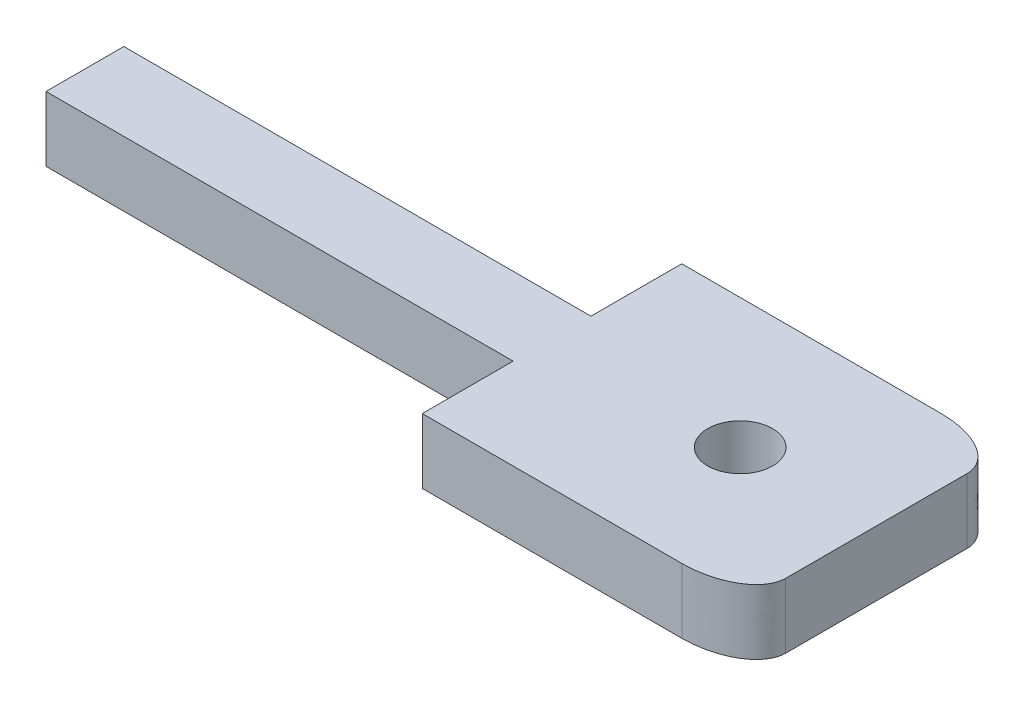
ISO-10303-21;
HEADER;
FILE_DESCRIPTION(('STEP AP214'),'2;1');
FILE_NAME('part.step','',(''),(''),'','','');
FILE_SCHEMA(('AUTOMOTIVE_DESIGN { 1 0 10303 214 1 1 1 1 }'));
ENDSEC;
DATA;
#1=APPLICATION_CONTEXT('core data for automotive mechanical design processes');
#2=APPLICATION_PROTOCOL_DEFINITION('international standard','automotive_design',2000,#1);
#3=PRODUCT_CONTEXT('',#1,'mechanical');
#4=PRODUCT('Part','Part','',(#3));
#5=PRODUCT_RELATED_PRODUCT_CATEGORY('part','',(#4));
#6=PRODUCT_DEFINITION_FORMATION('','',#4);
#7=PRODUCT_DEFINITION_CONTEXT('part definition',#1,'design');
#8=PRODUCT_DEFINITION('design','',#6,#7);
#9=PRODUCT_DEFINITION_SHAPE('','',#8);
#10=(LENGTH_UNIT() NAMED_UNIT(*) SI_UNIT(.MILLI.,.METRE.));
#11=(NAMED_UNIT(*) PLANE_ANGLE_UNIT() SI_UNIT($,.RADIAN.));
#12=(NAMED_UNIT(*) SI_UNIT($,.STERADIAN.) SOLID_ANGLE_UNIT());
#13=UNCERTAINTY_MEASURE_WITH_UNIT(LENGTH_MEASURE(1.E-05),#10,'distance_accuracy_value','');
#14=(GEOMETRIC_REPRESENTATION_CONTEXT(3) GLOBAL_UNCERTAINTY_ASSIGNED_CONTEXT((#13)) GLOBAL_UNIT_ASSIGNED_CONTEXT((#10,
#11,#12)) REPRESENTATION_CONTEXT('',''));
#15=CARTESIAN_POINT('',(0.,0.,0.));
#16=DIRECTION('',(0.,0.,1.));
#17=DIRECTION('',(1.,0.,0.));
#18=AXIS2_PLACEMENT_3D('',#15,#16,#17);
#19=CARTESIAN_POINT('',(-12.5,-2.5,20.));
#20=DIRECTION('',(1.,0.,0.));
#21=DIRECTION('',(0.,0.,-1.));
#22=AXIS2_PLACEMENT_3D('',#19,#20,#21);
#23=PLANE('',#22);
#24=DIRECTION('',(0.,-1.,0.));
#25=VECTOR('',#24,1.);
#26=CARTESIAN_POINT('',(-12.5,38.9965751817893,6.99999999998776));
#27=LINE('',#26,#25);
#28=CARTESIAN_POINT('',(-12.5,2.5,6.99999999998776));
#29=VERTEX_POINT('',#28);
#30=CARTESIAN_POINT('',(-12.5,-2.5,6.99999999998776));
#31=VERTEX_POINT('',#30);
#32=EDGE_CURVE('E132',#29,#31,#27,.T.);
#33=ORIENTED_EDGE('',*,*,#32,.F.);
#34=DIRECTION('',(0.,0.,-1.));
#35=VECTOR('',#34,1.);
#36=CARTESIAN_POINT('',(-12.5,2.5,20.));
#37=LINE('',#36,#35);
#38=CARTESIAN_POINT('',(-12.5,2.5,0.));
#39=VERTEX_POINT('',#38);
#40=EDGE_CURVE('E241',#29,#39,#37,.T.);
#41=ORIENTED_EDGE('',*,*,#40,.T.);
#42=DIRECTION('',(0.,-1.,0.));
#43=VECTOR('',#42,1.);
#44=CARTESIAN_POINT('',(-12.5,-2.5,0.));
#45=LINE('',#44,#43);
#46=CARTESIAN_POINT('',(-12.5,-2.5,0.));
#47=VERTEX_POINT('',#46);
#48=EDGE_CURVE('E186',#39,#47,#45,.T.);
#49=ORIENTED_EDGE('',*,*,#48,.T.);
#50=DIRECTION('',(0.,0.,-1.));
#51=VECTOR('',#50,1.);
#52=CARTESIAN_POINT('',(-12.5,-2.5,20.));
#53=LINE('',#52,#51);
#54=EDGE_CURVE('E234',#31,#47,#53,.T.);
#55=ORIENTED_EDGE('',*,*,#54,.F.);
#56=EDGE_LOOP('',(#33,#41,#49,#55));
#57=FACE_BOUND('',#56,.T.);
#58=ADVANCED_FACE('F38',(#57),#23,.F.);
#59=CARTESIAN_POINT('',(12.5,-2.5,20.));
#60=DIRECTION('',(-1.,0.,0.));
#61=DIRECTION('',(0.,0.,1.));
#62=AXIS2_PLACEMENT_3D('',#59,#60,#61);
#63=PLANE('',#62);
#64=DIRECTION('',(0.,0.,-1.));
#65=VECTOR('',#64,1.);
#66=CARTESIAN_POINT('',(12.5,2.5,20.));
#67=LINE('',#66,#65);
#68=CARTESIAN_POINT('',(12.5,2.5,17.));
#69=VERTEX_POINT('',#68);
#70=CARTESIAN_POINT('',(12.5,2.5,3.));
#71=VERTEX_POINT('',#70);
#72=EDGE_CURVE('E194',#69,#71,#67,.T.);
#73=ORIENTED_EDGE('',*,*,#72,.F.);
#74=CARTESIAN_POINT('',(12.5,-2.75,17.));
#75=CARTESIAN_POINT('',(12.5,-0.916666666666667,17.));
#76=CARTESIAN_POINT('',(12.5,0.916666666666667,17.));
#77=CARTESIAN_POINT('',(12.5,2.75,17.));
#78=(BOUNDED_CURVE() B_SPLINE_CURVE(3,(#74,#75,#76,#77),.UNSPECIFIED.,.F.,
.F.) B_SPLINE_CURVE_WITH_KNOTS((4,4),(-0.00275,0.00275),
.UNSPECIFIED.) CURVE() GEOMETRIC_REPRESENTATION_ITEM() RATIONAL_B_SPLINE_CURVE((1.,1.,1.,1.)) REPRESENTATION_ITEM(''));
#79=CARTESIAN_POINT('',(12.5,-2.5,17.));
#80=VERTEX_POINT('',#79);
#81=EDGE_CURVE('E338',#69,#80,#78,.F.);
#82=ORIENTED_EDGE('',*,*,#81,.T.);
#83=DIRECTION('',(0.,0.,-1.));
#84=VECTOR('',#83,1.);
#85=CARTESIAN_POINT('',(12.5,-2.5,20.));
#86=LINE('',#85,#84);
#87=CARTESIAN_POINT('',(12.5,-2.5,3.));
#88=VERTEX_POINT('',#87);
#89=EDGE_CURVE('E179',#80,#88,#86,.T.);
#90=ORIENTED_EDGE('',*,*,#89,.T.);
#91=CARTESIAN_POINT('',(12.5,2.75,3.));
#92=CARTESIAN_POINT('',(12.5,0.916666666666669,3.));
#93=CARTESIAN_POINT('',(12.5,-0.916666666666669,3.));
#94=CARTESIAN_POINT('',(12.5,-2.75,3.));
#95=(BOUNDED_CURVE() B_SPLINE_CURVE(3,(#91,#92,#93,#94),.UNSPECIFIED.,.F.,
.F.) B_SPLINE_CURVE_WITH_KNOTS((4,4),(-0.00525,0.00025),
.UNSPECIFIED.) CURVE() GEOMETRIC_REPRESENTATION_ITEM() RATIONAL_B_SPLINE_CURVE((1.,1.,1.,1.)) REPRESENTATION_ITEM(''));
#96=EDGE_CURVE('E359',#88,#71,#95,.F.);
#97=ORIENTED_EDGE('',*,*,#96,.T.);
#98=EDGE_LOOP('',(#73,#82,#90,#97));
#99=FACE_BOUND('',#98,.T.);
#100=ADVANCED_FACE('F218',(#99),#63,.F.);
#101=CARTESIAN_POINT('',(-12.5,2.5,20.));
#102=DIRECTION('',(0.,-1.,0.));
#103=DIRECTION('',(0.,0.,-1.));
#104=AXIS2_PLACEMENT_3D('',#101,#102,#103);
#105=PLANE('',#104);
#106=CARTESIAN_POINT('',(2.,2.5,10.));
#107=DIRECTION('',(0.,-1.,0.));
#108=DIRECTION('',(0.,0.,-1.));
#109=AXIS2_PLACEMENT_3D('',#106,#107,#108);
#110=CIRCLE('',#109,2.5);
#111=CARTESIAN_POINT('',(2.,2.5,7.5));
#112=VERTEX_POINT('',#111);
#113=EDGE_CURVE('E161',#112,#112,#110,.T.);
#114=ORIENTED_EDGE('',*,*,#113,.T.);
#115=EDGE_LOOP('',(#114));
#116=FACE_BOUND('',#115,.T.);
#117=DIRECTION('',(-1.,0.,0.));
#118=VECTOR('',#117,1.);
#119=CARTESIAN_POINT('',(6.5,2.5,20.));
#120=LINE('',#119,#118);
#121=CARTESIAN_POINT('',(7.5,2.5,20.));
#122=VERTEX_POINT('',#121);
#123=CARTESIAN_POINT('',(-12.5,2.5,20.));
#124=VERTEX_POINT('',#123);
#125=EDGE_CURVE('E170',#122,#124,#120,.T.);
#126=ORIENTED_EDGE('',*,*,#125,.F.);
#127=CARTESIAN_POINT('',(12.5,2.5,17.));
#128=CARTESIAN_POINT('',(12.5,2.5,20.));
#129=CARTESIAN_POINT('',(7.5,2.5,20.));
#130=(BOUNDED_CURVE() B_SPLINE_CURVE(2,(#127,#128,#129),.UNSPECIFIED.,.F.,
.F.) B_SPLINE_CURVE_WITH_KNOTS((3,3),(0.,1.),
.UNSPECIFIED.) CURVE() GEOMETRIC_REPRESENTATION_ITEM() RATIONAL_B_SPLINE_CURVE((1.,
0.707106781186548,1.)) REPRESENTATION_ITEM(''));
#131=EDGE_CURVE('E297',#122,#69,#130,.F.);
#132=ORIENTED_EDGE('',*,*,#131,.T.);
#133=ORIENTED_EDGE('',*,*,#72,.T.);
#134=CARTESIAN_POINT('',(7.5,2.5,0.));
#135=CARTESIAN_POINT('',(12.5,2.5,0.));
#136=CARTESIAN_POINT('',(12.5,2.5,3.));
#137=(BOUNDED_CURVE() B_SPLINE_CURVE(2,(#134,#135,#136),.UNSPECIFIED.,.F.,
.F.) B_SPLINE_CURVE_WITH_KNOTS((3,3),(0.,1.),
.UNSPECIFIED.) CURVE() GEOMETRIC_REPRESENTATION_ITEM() RATIONAL_B_SPLINE_CURVE((1.,
0.707106781186548,1.)) REPRESENTATION_ITEM(''));
#138=CARTESIAN_POINT('',(7.5,2.5,0.));
#139=VERTEX_POINT('',#138);
#140=EDGE_CURVE('E201',#71,#139,#137,.F.);
#141=ORIENTED_EDGE('',*,*,#140,.T.);
#142=DIRECTION('',(-1.,0.,0.));
#143=VECTOR('',#142,1.);
#144=CARTESIAN_POINT('',(-12.5,2.5,0.));
#145=LINE('',#144,#143);
#146=EDGE_CURVE('E164',#139,#39,#145,.T.);
#147=ORIENTED_EDGE('',*,*,#146,.T.);
#148=ORIENTED_EDGE('',*,*,#40,.F.);
#149=DIRECTION('',(1.,0.,0.));
#150=VECTOR('',#149,1.);
#151=CARTESIAN_POINT('',(-12.5,2.5,6.99999999998776));
#152=LINE('',#151,#150);
#153=CARTESIAN_POINT('',(-48.5,2.5,6.99999999998776));
#154=VERTEX_POINT('',#153);
#155=EDGE_CURVE('E151',#154,#29,#152,.T.);
#156=ORIENTED_EDGE('',*,*,#155,.F.);
#157=DIRECTION('',(0.,0.,-1.));
#158=VECTOR('',#157,1.);
#159=CARTESIAN_POINT('',(-48.5,2.5,6.99999999998776));
#160=LINE('',#159,#158);
#161=CARTESIAN_POINT('',(-48.5,2.5,12.9999999999878));
#162=VERTEX_POINT('',#161);
#163=EDGE_CURVE('E129',#162,#154,#160,.T.);
#164=ORIENTED_EDGE('',*,*,#163,.F.);
#165=DIRECTION('',(-1.,0.,0.));
#166=VECTOR('',#165,1.);
#167=CARTESIAN_POINT('',(-12.5,2.5,12.9999999999878));
#168=LINE('',#167,#166);
#169=CARTESIAN_POINT('',(-12.5,2.5,12.9999999999878));
#170=VERTEX_POINT('',#169);
#171=EDGE_CURVE('E152',#170,#162,#168,.T.);
#172=ORIENTED_EDGE('',*,*,#171,.F.);
#173=EDGE_CURVE('E198',#124,#170,#37,.T.);
#174=ORIENTED_EDGE('',*,*,#173,.F.);
#175=EDGE_LOOP('',(#126,#132,#133,#141,#147,#148,#156,#164,#172,#174));
#176=FACE_BOUND('',#175,.T.);
#177=ADVANCED_FACE('F207',(#116,#176),#105,.F.);
#178=ORIENTED_EDGE('',*,*,#173,.T.);
#179=DIRECTION('',(0.,-1.,0.));
#180=VECTOR('',#179,1.);
#181=CARTESIAN_POINT('',(-12.5,38.9965751817893,12.9999999999878));
#182=LINE('',#181,#180);
#183=CARTESIAN_POINT('',(-12.5,-2.5,12.9999999999878));
#184=VERTEX_POINT('',#183);
#185=EDGE_CURVE('E145',#170,#184,#182,.T.);
#186=ORIENTED_EDGE('',*,*,#185,.T.);
#187=CARTESIAN_POINT('',(-12.5,-2.5,20.));
#188=VERTEX_POINT('',#187);
#189=EDGE_CURVE('E240',#188,#184,#53,.T.);
#190=ORIENTED_EDGE('',*,*,#189,.F.);
#191=DIRECTION('',(0.,-1.,0.));
#192=VECTOR('',#191,1.);
#193=CARTESIAN_POINT('',(-12.5,-2.5,20.));
#194=LINE('',#193,#192);
#195=EDGE_CURVE('E167',#124,#188,#194,.T.);
#196=ORIENTED_EDGE('',*,*,#195,.F.);
#197=EDGE_LOOP('',(#178,#186,#190,#196));
#198=FACE_BOUND('',#197,.T.);
#199=ADVANCED_FACE('F217',(#198),#23,.F.);
#200=CARTESIAN_POINT('',(-12.5,-2.5,20.));
#201=DIRECTION('',(0.,1.,0.));
#202=DIRECTION('',(0.,0.,1.));
#203=AXIS2_PLACEMENT_3D('',#200,#201,#202);
#204=PLANE('',#203);
#205=CARTESIAN_POINT('',(2.,-2.5,10.));
#206=DIRECTION('',(0.,1.,0.));
#207=DIRECTION('',(0.,0.,1.));
#208=AXIS2_PLACEMENT_3D('',#205,#206,#207);
#209=CIRCLE('',#208,2.5);
#210=CARTESIAN_POINT('',(2.,-2.5,12.5));
#211=VERTEX_POINT('',#210);
#212=EDGE_CURVE('E153',#211,#211,#209,.T.);
#213=ORIENTED_EDGE('',*,*,#212,.T.);
#214=EDGE_LOOP('',(#213));
#215=FACE_BOUND('',#214,.T.);
#216=ORIENTED_EDGE('',*,*,#89,.F.);
#217=CARTESIAN_POINT('',(7.5,-2.5,20.));
#218=CARTESIAN_POINT('',(12.5,-2.5,20.));
#219=CARTESIAN_POINT('',(12.5,-2.5,17.));
#220=(BOUNDED_CURVE() B_SPLINE_CURVE(2,(#217,#218,#219),.UNSPECIFIED.,.F.,
.F.) B_SPLINE_CURVE_WITH_KNOTS((3,3),(0.,1.),
.UNSPECIFIED.) CURVE() GEOMETRIC_REPRESENTATION_ITEM() RATIONAL_B_SPLINE_CURVE((1.,
0.707106781186548,1.)) REPRESENTATION_ITEM(''));
#221=CARTESIAN_POINT('',(7.5,-2.5,20.));
#222=VERTEX_POINT('',#221);
#223=EDGE_CURVE('E52',#80,#222,#220,.F.);
#224=ORIENTED_EDGE('',*,*,#223,.T.);
#225=DIRECTION('',(1.,0.,0.));
#226=VECTOR('',#225,1.);
#227=CARTESIAN_POINT('',(-12.5,-2.5,20.));
#228=LINE('',#227,#226);
#229=EDGE_CURVE('E176',#188,#222,#228,.T.);
#230=ORIENTED_EDGE('',*,*,#229,.F.);
#231=ORIENTED_EDGE('',*,*,#189,.T.);
#232=DIRECTION('',(-1.,0.,0.));
#233=VECTOR('',#232,1.);
#234=CARTESIAN_POINT('',(-12.5,-2.5,12.9999999999878));
#235=LINE('',#234,#233);
#236=CARTESIAN_POINT('',(-48.5,-2.5,12.9999999999878));
#237=VERTEX_POINT('',#236);
#238=EDGE_CURVE('E59',#184,#237,#235,.T.);
#239=ORIENTED_EDGE('',*,*,#238,.T.);
#240=DIRECTION('',(0.,0.,-1.));
#241=VECTOR('',#240,1.);
#242=CARTESIAN_POINT('',(-48.5,-2.5,6.99999999998776));
#243=LINE('',#242,#241);
#244=CARTESIAN_POINT('',(-48.5,-2.5,6.99999999998776));
#245=VERTEX_POINT('',#244);
#246=EDGE_CURVE('E128',#237,#245,#243,.T.);
#247=ORIENTED_EDGE('',*,*,#246,.T.);
#248=DIRECTION('',(1.,0.,0.));
#249=VECTOR('',#248,1.);
#250=CARTESIAN_POINT('',(-12.5,-2.5,6.99999999998776));
#251=LINE('',#250,#249);
#252=EDGE_CURVE('E139',#245,#31,#251,.T.);
#253=ORIENTED_EDGE('',*,*,#252,.T.);
#254=ORIENTED_EDGE('',*,*,#54,.T.);
#255=DIRECTION('',(1.,0.,0.));
#256=VECTOR('',#255,1.);
#257=CARTESIAN_POINT('',(-12.5,-2.5,0.));
#258=LINE('',#257,#256);
#259=CARTESIAN_POINT('',(7.5,-2.5,0.));
#260=VERTEX_POINT('',#259);
#261=EDGE_CURVE('E173',#47,#260,#258,.T.);
#262=ORIENTED_EDGE('',*,*,#261,.T.);
#263=CARTESIAN_POINT('',(12.5,-2.5,3.));
#264=CARTESIAN_POINT('',(12.5,-2.5,0.));
#265=CARTESIAN_POINT('',(7.5,-2.5,0.));
#266=(BOUNDED_CURVE() B_SPLINE_CURVE(2,(#263,#264,#265),.UNSPECIFIED.,.F.,
.F.) B_SPLINE_CURVE_WITH_KNOTS((3,3),(0.,1.),
.UNSPECIFIED.) CURVE() GEOMETRIC_REPRESENTATION_ITEM() RATIONAL_B_SPLINE_CURVE((1.,
0.707106781186548,1.)) REPRESENTATION_ITEM(''));
#267=EDGE_CURVE('E260',#260,#88,#266,.F.);
#268=ORIENTED_EDGE('',*,*,#267,.T.);
#269=EDGE_LOOP('',(#216,#224,#230,#231,#239,#247,#253,#254,#262,#268));
#270=FACE_BOUND('',#269,.T.);
#271=ADVANCED_FACE('F138',(#215,#270),#204,.F.);
#272=CARTESIAN_POINT('',(0.,0.,20.));
#273=DIRECTION('',(0.,0.,-1.));
#274=DIRECTION('',(-1.,0.,0.));
#275=AXIS2_PLACEMENT_3D('',#272,#273,#274);
#276=PLANE('',#275);
#277=ORIENTED_EDGE('',*,*,#229,.T.);
#278=CARTESIAN_POINT('',(7.5,2.75,20.));
#279=CARTESIAN_POINT('',(7.5,0.916666666666667,20.));
#280=CARTESIAN_POINT('',(7.5,-0.916666666666667,20.));
#281=CARTESIAN_POINT('',(7.5,-2.75,20.));
#282=(BOUNDED_CURVE() B_SPLINE_CURVE(3,(#278,#279,#280,#281),.UNSPECIFIED.,.F.,
.F.) B_SPLINE_CURVE_WITH_KNOTS((4,4),(-0.00275,0.00275),
.UNSPECIFIED.) CURVE() GEOMETRIC_REPRESENTATION_ITEM() RATIONAL_B_SPLINE_CURVE((1.,1.,1.,1.)) REPRESENTATION_ITEM(''));
#283=EDGE_CURVE('E197',#222,#122,#282,.F.);
#284=ORIENTED_EDGE('',*,*,#283,.T.);
#285=ORIENTED_EDGE('',*,*,#125,.T.);
#286=ORIENTED_EDGE('',*,*,#195,.T.);
#287=EDGE_LOOP('',(#277,#284,#285,#286));
#288=FACE_BOUND('',#287,.T.);
#289=ADVANCED_FACE('F273',(#288),#276,.F.);
#290=CARTESIAN_POINT('',(0.,0.,0.));
#291=DIRECTION('',(0.,0.,-1.));
#292=DIRECTION('',(-1.,0.,0.));
#293=AXIS2_PLACEMENT_3D('',#290,#291,#292);
#294=PLANE('',#293);
#295=ORIENTED_EDGE('',*,*,#146,.F.);
#296=CARTESIAN_POINT('',(7.5,-2.75,0.));
#297=CARTESIAN_POINT('',(7.5,-0.916666666666669,0.));
#298=CARTESIAN_POINT('',(7.5,0.916666666666669,0.));
#299=CARTESIAN_POINT('',(7.5,2.75,0.));
#300=(BOUNDED_CURVE() B_SPLINE_CURVE(3,(#296,#297,#298,#299),.UNSPECIFIED.,.F.,
.F.) B_SPLINE_CURVE_WITH_KNOTS((4,4),(-0.00525,0.00025),
.UNSPECIFIED.) CURVE() GEOMETRIC_REPRESENTATION_ITEM() RATIONAL_B_SPLINE_CURVE((1.,1.,1.,1.)) REPRESENTATION_ITEM(''));
#301=EDGE_CURVE('E12',#139,#260,#300,.F.);
#302=ORIENTED_EDGE('',*,*,#301,.T.);
#303=ORIENTED_EDGE('',*,*,#261,.F.);
#304=ORIENTED_EDGE('',*,*,#48,.F.);
#305=EDGE_LOOP('',(#295,#302,#303,#304));
#306=FACE_BOUND('',#305,.T.);
#307=ADVANCED_FACE('F251',(#306),#294,.T.);
#308=CARTESIAN_POINT('',(2.,-2.5,10.));
#309=DIRECTION('',(0.,1.,0.));
#310=DIRECTION('',(0.,0.,1.));
#311=AXIS2_PLACEMENT_3D('',#308,#309,#310);
#312=CYLINDRICAL_SURFACE('',#311,2.5);
#313=ORIENTED_EDGE('',*,*,#212,.F.);
#314=EDGE_LOOP('',(#313));
#315=FACE_BOUND('',#314,.T.);
#316=ORIENTED_EDGE('',*,*,#113,.F.);
#317=EDGE_LOOP('',(#316));
#318=FACE_BOUND('',#317,.T.);
#319=ADVANCED_FACE('F315',(#315,#318),#312,.F.);
#320=CARTESIAN_POINT('',(7.5,-2.75,20.));
#321=CARTESIAN_POINT('',(7.5,-0.916666666666667,20.));
#322=CARTESIAN_POINT('',(7.5,0.916666666666667,20.));
#323=CARTESIAN_POINT('',(7.5,2.75,20.));
#324=CARTESIAN_POINT('',(12.5,-2.75,20.));
#325=CARTESIAN_POINT('',(12.5,-0.916666666666667,20.));
#326=CARTESIAN_POINT('',(12.5,0.916666666666667,20.));
#327=CARTESIAN_POINT('',(12.5,2.75,20.));
#328=CARTESIAN_POINT('',(12.5,-2.75,17.));
#329=CARTESIAN_POINT('',(12.5,-0.916666666666667,17.));
#330=CARTESIAN_POINT('',(12.5,0.916666666666667,17.));
#331=CARTESIAN_POINT('',(12.5,2.75,17.));
#332=(BOUNDED_SURFACE() B_SPLINE_SURFACE(2,3,((#320,#321,#322,#323),(#324,#325,#326,#327),(#328,
#329,#330,#331)),.UNSPECIFIED.,.F.,.F.,.F.) B_SPLINE_SURFACE_WITH_KNOTS((3,3),(4,4),(0.,1.),
(-0.00275,0.00275),
.UNSPECIFIED.) GEOMETRIC_REPRESENTATION_ITEM() RATIONAL_B_SPLINE_SURFACE(((1.,1.,1.,1.),
(0.707106781186548,0.707106781186548,0.707106781186548,0.707106781186548),(1.,1.,1.,1.))) REPRESENTATION_ITEM('') SURFACE());
#333=ORIENTED_EDGE('',*,*,#223,.F.);
#334=ORIENTED_EDGE('',*,*,#81,.F.);
#335=ORIENTED_EDGE('',*,*,#131,.F.);
#336=ORIENTED_EDGE('',*,*,#283,.F.);
#337=EDGE_LOOP('',(#333,#334,#335,#336));
#338=FACE_BOUND('',#337,.T.);
#339=ADVANCED_FACE('F303',(#338),#332,.T.);
#340=CARTESIAN_POINT('',(7.5,2.75,0.));
#341=CARTESIAN_POINT('',(7.5,0.916666666666669,0.));
#342=CARTESIAN_POINT('',(7.5,-0.916666666666669,0.));
#343=CARTESIAN_POINT('',(7.5,-2.75,0.));
#344=CARTESIAN_POINT('',(12.5,2.75,0.));
#345=CARTESIAN_POINT('',(12.5,0.916666666666669,0.));
#346=CARTESIAN_POINT('',(12.5,-0.916666666666669,0.));
#347=CARTESIAN_POINT('',(12.5,-2.75,0.));
#348=CARTESIAN_POINT('',(12.5,2.75,3.));
#349=CARTESIAN_POINT('',(12.5,0.916666666666669,3.));
#350=CARTESIAN_POINT('',(12.5,-0.916666666666669,3.));
#351=CARTESIAN_POINT('',(12.5,-2.75,3.));
#352=(BOUNDED_SURFACE() B_SPLINE_SURFACE(2,3,((#340,#341,#342,#343),(#344,#345,#346,#347),(#348,
#349,#350,#351)),.UNSPECIFIED.,.F.,.F.,.F.) B_SPLINE_SURFACE_WITH_KNOTS((3,3),(4,4),(0.,1.),
(-0.00525,0.00025),
.UNSPECIFIED.) GEOMETRIC_REPRESENTATION_ITEM() RATIONAL_B_SPLINE_SURFACE(((1.,1.,1.,1.),
(0.707106781186548,0.707106781186548,0.707106781186548,0.707106781186548),(1.,1.,1.,1.))) REPRESENTATION_ITEM('') SURFACE());
#353=ORIENTED_EDGE('',*,*,#267,.F.);
#354=ORIENTED_EDGE('',*,*,#301,.F.);
#355=ORIENTED_EDGE('',*,*,#140,.F.);
#356=ORIENTED_EDGE('',*,*,#96,.F.);
#357=EDGE_LOOP('',(#353,#354,#355,#356));
#358=FACE_BOUND('',#357,.T.);
#359=ADVANCED_FACE('F41',(#358),#352,.T.);
#360=CARTESIAN_POINT('',(-12.5,38.9965751817893,12.9999999999878));
#361=DIRECTION('',(0.,0.,-1.));
#362=DIRECTION('',(-1.,0.,0.));
#363=AXIS2_PLACEMENT_3D('',#360,#361,#362);
#364=PLANE('',#363);
#365=ORIENTED_EDGE('',*,*,#185,.F.);
#366=ORIENTED_EDGE('',*,*,#171,.T.);
#367=DIRECTION('',(0.,-1.,0.));
#368=VECTOR('',#367,1.);
#369=CARTESIAN_POINT('',(-48.5,38.9965751817893,12.9999999999878));
#370=LINE('',#369,#368);
#371=EDGE_CURVE('E133',#162,#237,#370,.T.);
#372=ORIENTED_EDGE('',*,*,#371,.T.);
#373=ORIENTED_EDGE('',*,*,#238,.F.);
#374=EDGE_LOOP('',(#365,#366,#372,#373));
#375=FACE_BOUND('',#374,.T.);
#376=ADVANCED_FACE('F377',(#375),#364,.F.);
#377=CARTESIAN_POINT('',(-48.5,38.9965751817893,6.99999999998776));
#378=DIRECTION('',(1.,0.,0.));
#379=DIRECTION('',(0.,0.,-1.));
#380=AXIS2_PLACEMENT_3D('',#377,#378,#379);
#381=PLANE('',#380);
#382=ORIENTED_EDGE('',*,*,#371,.F.);
#383=ORIENTED_EDGE('',*,*,#163,.T.);
#384=DIRECTION('',(0.,-1.,0.));
#385=VECTOR('',#384,1.);
#386=CARTESIAN_POINT('',(-48.5,38.9965751817893,6.99999999998776));
#387=LINE('',#386,#385);
#388=EDGE_CURVE('E124',#154,#245,#387,.T.);
#389=ORIENTED_EDGE('',*,*,#388,.T.);
#390=ORIENTED_EDGE('',*,*,#246,.F.);
#391=EDGE_LOOP('',(#382,#383,#389,#390));
#392=FACE_BOUND('',#391,.T.);
#393=ADVANCED_FACE('F127',(#392),#381,.F.);
#394=CARTESIAN_POINT('',(-12.5,38.9965751817893,6.99999999998776));
#395=DIRECTION('',(0.,0.,1.));
#396=DIRECTION('',(1.,0.,0.));
#397=AXIS2_PLACEMENT_3D('',#394,#395,#396);
#398=PLANE('',#397);
#399=ORIENTED_EDGE('',*,*,#388,.F.);
#400=ORIENTED_EDGE('',*,*,#155,.T.);
#401=ORIENTED_EDGE('',*,*,#32,.T.);
#402=ORIENTED_EDGE('',*,*,#252,.F.);
#403=EDGE_LOOP('',(#399,#400,#401,#402));
#404=FACE_BOUND('',#403,.T.);
#405=ADVANCED_FACE('F143',(#404),#398,.F.);
#406=CLOSED_SHELL('',(#58,#100,#177,#199,#271,#289,#307,#319,#339,#359,#376,#393,#405));
#407=MANIFOLD_SOLID_BREP('B2',#406);
#408=ADVANCED_BREP_SHAPE_REPRESENTATION('',(#18,#407),#14);
#409=SHAPE_DEFINITION_REPRESENTATION(#9,#408);
ENDSEC;
END-ISO-10303-21;
